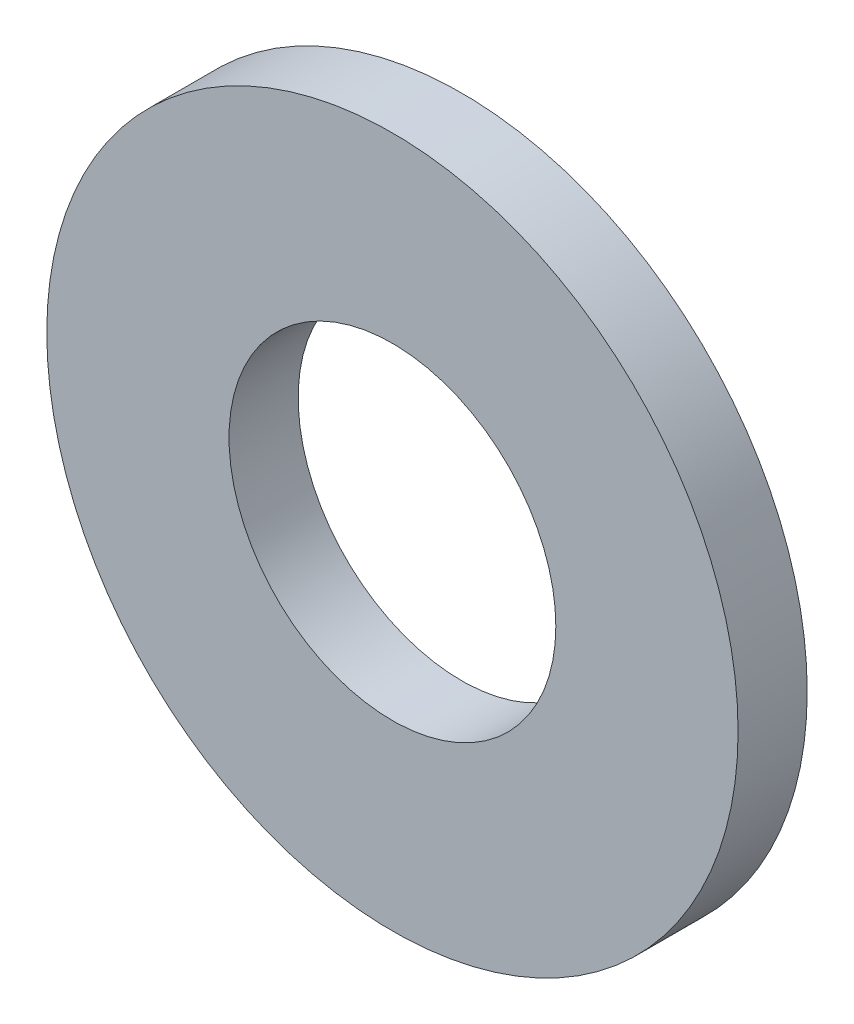
ISO-10303-21;
HEADER;
FILE_DESCRIPTION(('STEP AP214'),'2;1');
FILE_NAME('part.step','',(''),(''),'','','');
FILE_SCHEMA(('AUTOMOTIVE_DESIGN { 1 0 10303 214 1 1 1 1 }'));
ENDSEC;
DATA;
#1=APPLICATION_CONTEXT('core data for automotive mechanical design processes');
#2=APPLICATION_PROTOCOL_DEFINITION('international standard','automotive_design',2000,#1);
#3=PRODUCT_CONTEXT('',#1,'mechanical');
#4=PRODUCT('Part','Part','',(#3));
#5=PRODUCT_RELATED_PRODUCT_CATEGORY('part','',(#4));
#6=PRODUCT_DEFINITION_FORMATION('','',#4);
#7=PRODUCT_DEFINITION_CONTEXT('part definition',#1,'design');
#8=PRODUCT_DEFINITION('design','',#6,#7);
#9=PRODUCT_DEFINITION_SHAPE('','',#8);
#10=(LENGTH_UNIT() NAMED_UNIT(*) SI_UNIT(.MILLI.,.METRE.));
#11=(NAMED_UNIT(*) PLANE_ANGLE_UNIT() SI_UNIT($,.RADIAN.));
#12=(NAMED_UNIT(*) SI_UNIT($,.STERADIAN.) SOLID_ANGLE_UNIT());
#13=UNCERTAINTY_MEASURE_WITH_UNIT(LENGTH_MEASURE(1.E-05),#10,'distance_accuracy_value','');
#14=(GEOMETRIC_REPRESENTATION_CONTEXT(3) GLOBAL_UNCERTAINTY_ASSIGNED_CONTEXT((#13)) GLOBAL_UNIT_ASSIGNED_CONTEXT((#10,
#11,#12)) REPRESENTATION_CONTEXT('',''));
#15=CARTESIAN_POINT('',(0.,0.,0.));
#16=DIRECTION('',(0.,0.,1.));
#17=DIRECTION('',(1.,0.,0.));
#18=AXIS2_PLACEMENT_3D('',#15,#16,#17);
#19=CARTESIAN_POINT('',(0.,0.,1.1));
#20=DIRECTION('',(0.,0.,1.));
#21=DIRECTION('',(1.,0.,0.));
#22=AXIS2_PLACEMENT_3D('',#19,#20,#21);
#23=PLANE('',#22);
#24=CARTESIAN_POINT('',(0.,0.,1.1));
#25=DIRECTION('',(0.,0.,1.));
#26=DIRECTION('',(1.,0.,0.));
#27=AXIS2_PLACEMENT_3D('',#24,#25,#26);
#28=CIRCLE('',#27,5.5);
#29=CARTESIAN_POINT('',(5.5,0.,1.1));
#30=VERTEX_POINT('',#29);
#31=EDGE_CURVE('E10',#30,#30,#28,.T.);
#32=ORIENTED_EDGE('',*,*,#31,.T.);
#33=EDGE_LOOP('',(#32));
#34=FACE_BOUND('',#33,.T.);
#35=CARTESIAN_POINT('',(0.,0.,1.1));
#36=DIRECTION('',(0.,0.,1.));
#37=DIRECTION('',(1.,0.,0.));
#38=AXIS2_PLACEMENT_3D('',#35,#36,#37);
#39=CIRCLE('',#38,2.6);
#40=CARTESIAN_POINT('',(2.6,0.,1.1));
#41=VERTEX_POINT('',#40);
#42=EDGE_CURVE('E41',#41,#41,#39,.T.);
#43=ORIENTED_EDGE('',*,*,#42,.F.);
#44=EDGE_LOOP('',(#43));
#45=FACE_BOUND('',#44,.T.);
#46=ADVANCED_FACE('F30',(#34,#45),#23,.T.);
#47=CARTESIAN_POINT('',(0.,0.,0.));
#48=DIRECTION('',(0.,0.,1.));
#49=DIRECTION('',(1.,0.,0.));
#50=AXIS2_PLACEMENT_3D('',#47,#48,#49);
#51=PLANE('',#50);
#52=CARTESIAN_POINT('',(0.,0.,0.));
#53=DIRECTION('',(0.,0.,1.));
#54=DIRECTION('',(1.,0.,0.));
#55=AXIS2_PLACEMENT_3D('',#52,#53,#54);
#56=CIRCLE('',#55,5.5);
#57=CARTESIAN_POINT('',(5.5,0.,0.));
#58=VERTEX_POINT('',#57);
#59=EDGE_CURVE('E34',#58,#58,#56,.T.);
#60=ORIENTED_EDGE('',*,*,#59,.F.);
#61=EDGE_LOOP('',(#60));
#62=FACE_BOUND('',#61,.T.);
#63=CARTESIAN_POINT('',(0.,0.,0.));
#64=DIRECTION('',(0.,0.,1.));
#65=DIRECTION('',(1.,0.,0.));
#66=AXIS2_PLACEMENT_3D('',#63,#64,#65);
#67=CIRCLE('',#66,2.6);
#68=CARTESIAN_POINT('',(2.6,0.,0.));
#69=VERTEX_POINT('',#68);
#70=EDGE_CURVE('E43',#69,#69,#67,.T.);
#71=ORIENTED_EDGE('',*,*,#70,.T.);
#72=EDGE_LOOP('',(#71));
#73=FACE_BOUND('',#72,.T.);
#74=ADVANCED_FACE('F53',(#62,#73),#51,.F.);
#75=CARTESIAN_POINT('',(0.,0.,1.1));
#76=DIRECTION('',(0.,0.,-1.));
#77=DIRECTION('',(-1.,0.,0.));
#78=AXIS2_PLACEMENT_3D('',#75,#76,#77);
#79=CYLINDRICAL_SURFACE('',#78,5.5);
#80=ORIENTED_EDGE('',*,*,#31,.F.);
#81=EDGE_LOOP('',(#80));
#82=FACE_BOUND('',#81,.T.);
#83=ORIENTED_EDGE('',*,*,#59,.T.);
#84=EDGE_LOOP('',(#83));
#85=FACE_BOUND('',#84,.T.);
#86=ADVANCED_FACE('F32',(#82,#85),#79,.T.);
#87=CARTESIAN_POINT('',(0.,0.,1.1));
#88=DIRECTION('',(0.,0.,-1.));
#89=DIRECTION('',(-1.,0.,0.));
#90=AXIS2_PLACEMENT_3D('',#87,#88,#89);
#91=CYLINDRICAL_SURFACE('',#90,2.6);
#92=ORIENTED_EDGE('',*,*,#42,.T.);
#93=EDGE_LOOP('',(#92));
#94=FACE_BOUND('',#93,.T.);
#95=ORIENTED_EDGE('',*,*,#70,.F.);
#96=EDGE_LOOP('',(#95));
#97=FACE_BOUND('',#96,.T.);
#98=ADVANCED_FACE('F49',(#94,#97),#91,.F.);
#99=CLOSED_SHELL('',(#46,#74,#86,#98));
#100=MANIFOLD_SOLID_BREP('B2',#99);
#101=ADVANCED_BREP_SHAPE_REPRESENTATION('',(#18,#100),#14);
#102=SHAPE_DEFINITION_REPRESENTATION(#9,#101);
ENDSEC;
END-ISO-10303-21;
